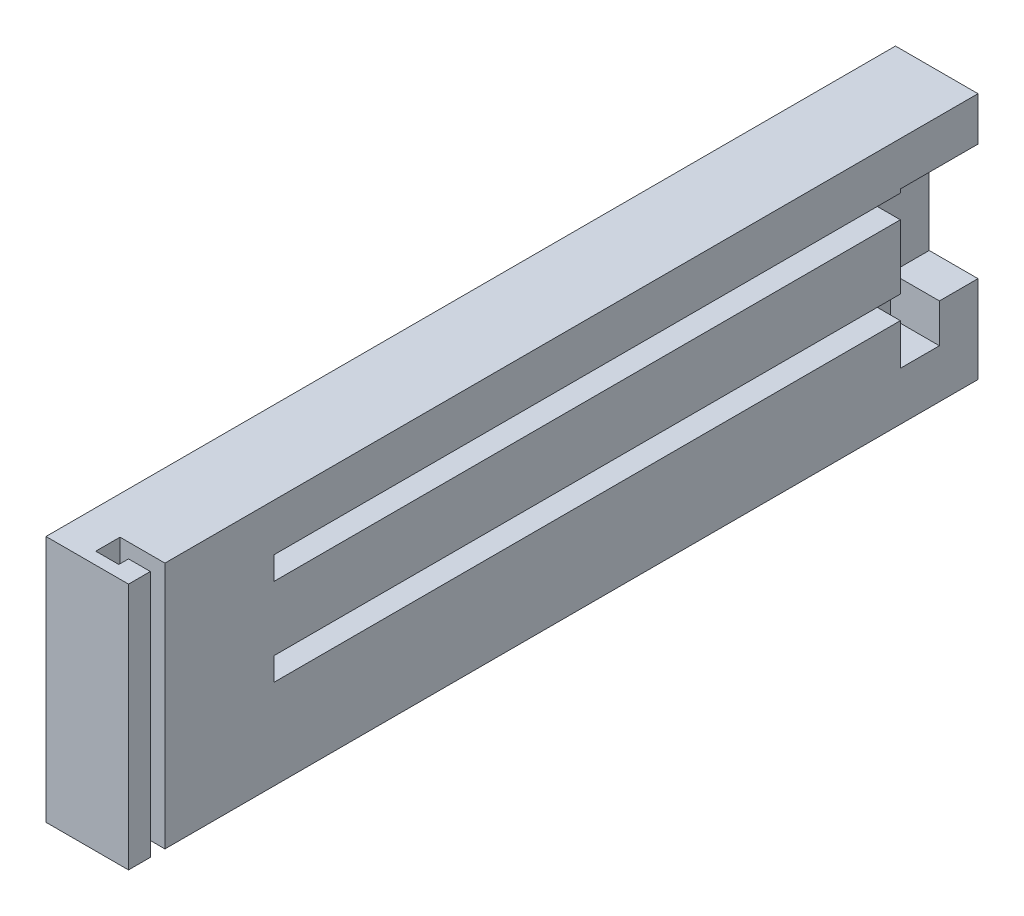
ISO-10303-21;
HEADER;
FILE_DESCRIPTION(('STEP AP214'),'2;1');
FILE_NAME('part.step','',(''),(''),'','','');
FILE_SCHEMA(('AUTOMOTIVE_DESIGN { 1 0 10303 214 1 1 1 1 }'));
ENDSEC;
DATA;
#1=APPLICATION_CONTEXT('core data for automotive mechanical design processes');
#2=APPLICATION_PROTOCOL_DEFINITION('international standard','automotive_design',2000,#1);
#3=PRODUCT_CONTEXT('',#1,'mechanical');
#4=PRODUCT('Part','Part','',(#3));
#5=PRODUCT_RELATED_PRODUCT_CATEGORY('part','',(#4));
#6=PRODUCT_DEFINITION_FORMATION('','',#4);
#7=PRODUCT_DEFINITION_CONTEXT('part definition',#1,'design');
#8=PRODUCT_DEFINITION('design','',#6,#7);
#9=PRODUCT_DEFINITION_SHAPE('','',#8);
#10=(LENGTH_UNIT() NAMED_UNIT(*) SI_UNIT(.MILLI.,.METRE.));
#11=(NAMED_UNIT(*) PLANE_ANGLE_UNIT() SI_UNIT($,.RADIAN.));
#12=(NAMED_UNIT(*) SI_UNIT($,.STERADIAN.) SOLID_ANGLE_UNIT());
#13=UNCERTAINTY_MEASURE_WITH_UNIT(LENGTH_MEASURE(1.E-05),#10,'distance_accuracy_value','');
#14=(GEOMETRIC_REPRESENTATION_CONTEXT(3) GLOBAL_UNCERTAINTY_ASSIGNED_CONTEXT((#13)) GLOBAL_UNIT_ASSIGNED_CONTEXT((#10,
#11,#12)) REPRESENTATION_CONTEXT('',''));
#15=CARTESIAN_POINT('',(0.,0.,0.));
#16=DIRECTION('',(0.,0.,1.));
#17=DIRECTION('',(1.,0.,0.));
#18=AXIS2_PLACEMENT_3D('',#15,#16,#17);
#19=CARTESIAN_POINT('',(17.,0.,0.));
#20=DIRECTION('',(-1.,0.,0.));
#21=DIRECTION('',(0.,0.,1.));
#22=AXIS2_PLACEMENT_3D('',#19,#20,#21);
#23=PLANE('',#22);
#24=DIRECTION('',(0.,0.,-1.));
#25=VECTOR('',#24,1.);
#26=CARTESIAN_POINT('',(17.,-10.4427333974976,-94.4379210779596));
#27=LINE('',#26,#25);
#28=CARTESIAN_POINT('',(17.,-10.4427333974976,-94.4379210779596));
#29=VERTEX_POINT('',#28);
#30=CARTESIAN_POINT('',(17.,-10.4427333974976,-102.48792107796));
#31=VERTEX_POINT('',#30);
#32=EDGE_CURVE('E220',#29,#31,#27,.T.);
#33=ORIENTED_EDGE('',*,*,#32,.F.);
#34=DIRECTION('',(0.,-1.,0.));
#35=VECTOR('',#34,1.);
#36=CARTESIAN_POINT('',(17.,0.,-94.4379210779596));
#37=LINE('',#36,#35);
#38=CARTESIAN_POINT('',(17.,-1.94273339749771,-94.4379210779596));
#39=VERTEX_POINT('',#38);
#40=EDGE_CURVE('E275',#39,#29,#37,.T.);
#41=ORIENTED_EDGE('',*,*,#40,.F.);
#42=DIRECTION('',(0.,0.,-1.));
#43=VECTOR('',#42,1.);
#44=CARTESIAN_POINT('',(17.,-1.94273339749762,34.5620789220404));
#45=LINE('',#44,#43);
#46=CARTESIAN_POINT('',(17.,-1.94273339749762,34.5620789220404));
#47=VERTEX_POINT('',#46);
#48=EDGE_CURVE('E317',#47,#39,#45,.T.);
#49=ORIENTED_EDGE('',*,*,#48,.F.);
#50=DIRECTION('',(0.,-1.,0.));
#51=VECTOR('',#50,1.);
#52=CARTESIAN_POINT('',(17.,0.,34.5620789220404));
#53=LINE('',#52,#51);
#54=CARTESIAN_POINT('',(17.,2.80726660250238,34.5620789220404));
#55=VERTEX_POINT('',#54);
#56=EDGE_CURVE('E312',#55,#47,#53,.T.);
#57=ORIENTED_EDGE('',*,*,#56,.F.);
#58=DIRECTION('',(0.,0.,-1.));
#59=VECTOR('',#58,1.);
#60=CARTESIAN_POINT('',(17.,2.80726660250238,34.5620789220404));
#61=LINE('',#60,#59);
#62=CARTESIAN_POINT('',(17.,2.80726660250229,-94.4379210779596));
#63=VERTEX_POINT('',#62);
#64=EDGE_CURVE('E322',#55,#63,#61,.T.);
#65=ORIENTED_EDGE('',*,*,#64,.T.);
#66=DIRECTION('',(0.,-1.,0.));
#67=VECTOR('',#66,1.);
#68=CARTESIAN_POINT('',(17.,0.,-94.4379210779596));
#69=LINE('',#68,#67);
#70=CARTESIAN_POINT('',(17.,16.0572666025023,-94.4379210779596));
#71=VERTEX_POINT('',#70);
#72=EDGE_CURVE('E264',#71,#63,#69,.T.);
#73=ORIENTED_EDGE('',*,*,#72,.F.);
#74=DIRECTION('',(0.,0.,-1.));
#75=VECTOR('',#74,1.);
#76=CARTESIAN_POINT('',(17.,16.0572666025024,34.5620789220404));
#77=LINE('',#76,#75);
#78=CARTESIAN_POINT('',(17.,16.0572666025024,34.5620789220404));
#79=VERTEX_POINT('',#78);
#80=EDGE_CURVE('E340',#79,#71,#77,.T.);
#81=ORIENTED_EDGE('',*,*,#80,.F.);
#82=DIRECTION('',(0.,1.,0.));
#83=VECTOR('',#82,1.);
#84=CARTESIAN_POINT('',(17.,16.0572666025024,34.5620789220404));
#85=LINE('',#84,#83);
#86=CARTESIAN_POINT('',(17.,20.8072666025024,34.5620789220404));
#87=VERTEX_POINT('',#86);
#88=EDGE_CURVE('E348',#79,#87,#85,.T.);
#89=ORIENTED_EDGE('',*,*,#88,.T.);
#90=DIRECTION('',(0.,0.,-1.));
#91=VECTOR('',#90,1.);
#92=CARTESIAN_POINT('',(17.,20.8072666025024,34.5620789220404));
#93=LINE('',#92,#91);
#94=CARTESIAN_POINT('',(17.,20.8072666025023,-94.4379210779596));
#95=VERTEX_POINT('',#94);
#96=EDGE_CURVE('E344',#87,#95,#93,.T.);
#97=ORIENTED_EDGE('',*,*,#96,.T.);
#98=DIRECTION('',(0.,-1.,0.));
#99=VECTOR('',#98,1.);
#100=CARTESIAN_POINT('',(17.,0.,-94.4379210779596));
#101=LINE('',#100,#99);
#102=CARTESIAN_POINT('',(17.,21.5572666025024,-94.4379210779596));
#103=VERTEX_POINT('',#102);
#104=EDGE_CURVE('E252',#103,#95,#101,.T.);
#105=ORIENTED_EDGE('',*,*,#104,.F.);
#106=DIRECTION('',(0.,0.,-1.));
#107=VECTOR('',#106,1.);
#108=CARTESIAN_POINT('',(17.,21.5572666025024,-94.4379210779596));
#109=LINE('',#108,#107);
#110=CARTESIAN_POINT('',(17.,21.5572666025024,-110.43792107796));
#111=VERTEX_POINT('',#110);
#112=EDGE_CURVE('E292',#103,#111,#109,.T.);
#113=ORIENTED_EDGE('',*,*,#112,.T.);
#114=DIRECTION('',(0.,-1.,0.));
#115=VECTOR('',#114,1.);
#116=CARTESIAN_POINT('',(17.,30.5572666025024,-110.43792107796));
#117=LINE('',#116,#115);
#118=CARTESIAN_POINT('',(17.,30.5572666025024,-110.43792107796));
#119=VERTEX_POINT('',#118);
#120=EDGE_CURVE('E424',#119,#111,#117,.T.);
#121=ORIENTED_EDGE('',*,*,#120,.F.);
#122=DIRECTION('',(0.,0.,-1.));
#123=VECTOR('',#122,1.);
#124=CARTESIAN_POINT('',(17.,30.5572666025024,64.5620789220404));
#125=LINE('',#124,#123);
#126=CARTESIAN_POINT('',(17.,30.5572666025024,57.0620789220404));
#127=VERTEX_POINT('',#126);
#128=EDGE_CURVE('E423',#127,#119,#125,.T.);
#129=ORIENTED_EDGE('',*,*,#128,.F.);
#130=DIRECTION('',(0.,1.,0.));
#131=VECTOR('',#130,1.);
#132=CARTESIAN_POINT('',(17.,-20.4427333974976,57.0620789220404));
#133=LINE('',#132,#131);
#134=CARTESIAN_POINT('',(17.,-20.4427333974976,57.0620789220404));
#135=VERTEX_POINT('',#134);
#136=EDGE_CURVE('E410',#135,#127,#133,.T.);
#137=ORIENTED_EDGE('',*,*,#136,.F.);
#138=DIRECTION('',(0.,0.,-1.));
#139=VECTOR('',#138,1.);
#140=CARTESIAN_POINT('',(17.,-20.4427333974976,64.5620789220404));
#141=LINE('',#140,#139);
#142=CARTESIAN_POINT('',(17.,-20.4427333974976,-110.43792107796));
#143=VERTEX_POINT('',#142);
#144=EDGE_CURVE('E428',#135,#143,#141,.T.);
#145=ORIENTED_EDGE('',*,*,#144,.T.);
#146=CARTESIAN_POINT('',(17.,-2.4427333974976,-110.43792107796));
#147=VERTEX_POINT('',#146);
#148=EDGE_CURVE('E422',#147,#143,#117,.T.);
#149=ORIENTED_EDGE('',*,*,#148,.F.);
#150=DIRECTION('',(0.,0.,-1.));
#151=VECTOR('',#150,1.);
#152=CARTESIAN_POINT('',(17.,-2.4427333974976,-94.4379210779596));
#153=LINE('',#152,#151);
#154=CARTESIAN_POINT('',(17.,-2.4427333974976,-102.48792107796));
#155=VERTEX_POINT('',#154);
#156=EDGE_CURVE('E234',#155,#147,#153,.T.);
#157=ORIENTED_EDGE('',*,*,#156,.F.);
#158=DIRECTION('',(0.,1.,0.));
#159=VECTOR('',#158,1.);
#160=CARTESIAN_POINT('',(17.,-10.4427333974976,-102.48792107796));
#161=LINE('',#160,#159);
#162=EDGE_CURVE('E212',#31,#155,#161,.T.);
#163=ORIENTED_EDGE('',*,*,#162,.F.);
#164=EDGE_LOOP('',(#33,#41,#49,#57,#65,#73,#81,#89,#97,#105,#113,#121,#129,#137,#145,#149,#157,#163));
#165=FACE_BOUND('',#164,.T.);
#166=ADVANCED_FACE('F45',(#165),#23,.F.);
#167=CARTESIAN_POINT('',(17.,20.8072666025024,34.5620789220404));
#168=DIRECTION('',(0.,-1.,0.));
#169=DIRECTION('',(0.,0.,-1.));
#170=AXIS2_PLACEMENT_3D('',#167,#168,#169);
#171=PLANE('',#170);
#172=DIRECTION('',(0.,0.,-1.));
#173=VECTOR('',#172,1.);
#174=CARTESIAN_POINT('',(12.25,20.8072666025024,34.5620789220404));
#175=LINE('',#174,#173);
#176=CARTESIAN_POINT('',(12.25,20.8072666025024,34.5620789220404));
#177=VERTEX_POINT('',#176);
#178=CARTESIAN_POINT('',(12.25,20.8072666025023,-94.4379210779596));
#179=VERTEX_POINT('',#178);
#180=EDGE_CURVE('E291',#177,#179,#175,.T.);
#181=ORIENTED_EDGE('',*,*,#180,.T.);
#182=DIRECTION('',(-1.,0.,0.));
#183=VECTOR('',#182,1.);
#184=CARTESIAN_POINT('',(0.,20.8072666025023,-94.4379210779596));
#185=LINE('',#184,#183);
#186=EDGE_CURVE('E255',#95,#179,#185,.T.);
#187=ORIENTED_EDGE('',*,*,#186,.F.);
#188=ORIENTED_EDGE('',*,*,#96,.F.);
#189=DIRECTION('',(-1.,0.,0.));
#190=VECTOR('',#189,1.);
#191=CARTESIAN_POINT('',(17.,20.8072666025024,34.5620789220404));
#192=LINE('',#191,#190);
#193=EDGE_CURVE('E305',#87,#177,#192,.T.);
#194=ORIENTED_EDGE('',*,*,#193,.T.);
#195=EDGE_LOOP('',(#181,#187,#188,#194));
#196=FACE_BOUND('',#195,.T.);
#197=ADVANCED_FACE('F512',(#196),#171,.T.);
#198=CARTESIAN_POINT('',(12.25,16.0572666025024,34.5620789220404));
#199=DIRECTION('',(-1.,0.,0.));
#200=DIRECTION('',(0.,0.,1.));
#201=AXIS2_PLACEMENT_3D('',#198,#199,#200);
#202=PLANE('',#201);
#203=DIRECTION('',(0.,-1.,0.));
#204=VECTOR('',#203,1.);
#205=CARTESIAN_POINT('',(12.25,0.,-94.4379210779596));
#206=LINE('',#205,#204);
#207=CARTESIAN_POINT('',(12.25,16.0572666025023,-94.4379210779596));
#208=VERTEX_POINT('',#207);
#209=EDGE_CURVE('E258',#179,#208,#206,.T.);
#210=ORIENTED_EDGE('',*,*,#209,.F.);
#211=ORIENTED_EDGE('',*,*,#180,.F.);
#212=DIRECTION('',(0.,1.,0.));
#213=VECTOR('',#212,1.);
#214=CARTESIAN_POINT('',(12.25,16.0572666025024,34.5620789220404));
#215=LINE('',#214,#213);
#216=CARTESIAN_POINT('',(12.25,16.0572666025024,34.5620789220404));
#217=VERTEX_POINT('',#216);
#218=EDGE_CURVE('E356',#217,#177,#215,.T.);
#219=ORIENTED_EDGE('',*,*,#218,.F.);
#220=DIRECTION('',(0.,0.,-1.));
#221=VECTOR('',#220,1.);
#222=CARTESIAN_POINT('',(12.25,16.0572666025024,34.5620789220404));
#223=LINE('',#222,#221);
#224=EDGE_CURVE('E336',#217,#208,#223,.T.);
#225=ORIENTED_EDGE('',*,*,#224,.T.);
#226=EDGE_LOOP('',(#210,#211,#219,#225));
#227=FACE_BOUND('',#226,.T.);
#228=ADVANCED_FACE('F517',(#227),#202,.F.);
#229=CARTESIAN_POINT('',(17.,16.0572666025024,34.5620789220404));
#230=DIRECTION('',(0.,-1.,0.));
#231=DIRECTION('',(0.,0.,-1.));
#232=AXIS2_PLACEMENT_3D('',#229,#230,#231);
#233=PLANE('',#232);
#234=DIRECTION('',(1.,0.,0.));
#235=VECTOR('',#234,1.);
#236=CARTESIAN_POINT('',(0.,16.0572666025023,-94.4379210779596));
#237=LINE('',#236,#235);
#238=EDGE_CURVE('E261',#208,#71,#237,.T.);
#239=ORIENTED_EDGE('',*,*,#238,.F.);
#240=ORIENTED_EDGE('',*,*,#224,.F.);
#241=DIRECTION('',(-1.,0.,0.));
#242=VECTOR('',#241,1.);
#243=CARTESIAN_POINT('',(17.,16.0572666025024,34.5620789220404));
#244=LINE('',#243,#242);
#245=EDGE_CURVE('E352',#79,#217,#244,.T.);
#246=ORIENTED_EDGE('',*,*,#245,.F.);
#247=ORIENTED_EDGE('',*,*,#80,.T.);
#248=EDGE_LOOP('',(#239,#240,#246,#247));
#249=FACE_BOUND('',#248,.T.);
#250=ADVANCED_FACE('F550',(#249),#233,.F.);
#251=CARTESIAN_POINT('',(0.,-1.94273339749762,34.5620789220404));
#252=DIRECTION('',(0.,1.,0.));
#253=DIRECTION('',(0.,0.,1.));
#254=AXIS2_PLACEMENT_3D('',#251,#252,#253);
#255=PLANE('',#254);
#256=ORIENTED_EDGE('',*,*,#48,.T.);
#257=DIRECTION('',(1.,0.,0.));
#258=VECTOR('',#257,1.);
#259=CARTESIAN_POINT('',(0.,-1.94273339749771,-94.4379210779596));
#260=LINE('',#259,#258);
#261=CARTESIAN_POINT('',(12.25,-1.94273339749771,-94.4379210779596));
#262=VERTEX_POINT('',#261);
#263=EDGE_CURVE('E272',#262,#39,#260,.T.);
#264=ORIENTED_EDGE('',*,*,#263,.F.);
#265=DIRECTION('',(0.,0.,-1.));
#266=VECTOR('',#265,1.);
#267=CARTESIAN_POINT('',(12.25,-1.94273339749762,34.5620789220404));
#268=LINE('',#267,#266);
#269=CARTESIAN_POINT('',(12.25,-1.94273339749762,34.5620789220404));
#270=VERTEX_POINT('',#269);
#271=EDGE_CURVE('E316',#270,#262,#268,.T.);
#272=ORIENTED_EDGE('',*,*,#271,.F.);
#273=DIRECTION('',(1.,0.,0.));
#274=VECTOR('',#273,1.);
#275=CARTESIAN_POINT('',(0.,-1.94273339749762,34.5620789220404));
#276=LINE('',#275,#274);
#277=EDGE_CURVE('E301',#270,#47,#276,.T.);
#278=ORIENTED_EDGE('',*,*,#277,.T.);
#279=EDGE_LOOP('',(#256,#264,#272,#278));
#280=FACE_BOUND('',#279,.T.);
#281=ADVANCED_FACE('F544',(#280),#255,.T.);
#282=CARTESIAN_POINT('',(0.,2.80726660250238,34.5620789220404));
#283=DIRECTION('',(0.,1.,0.));
#284=DIRECTION('',(0.,0.,1.));
#285=AXIS2_PLACEMENT_3D('',#282,#283,#284);
#286=PLANE('',#285);
#287=DIRECTION('',(-1.,0.,0.));
#288=VECTOR('',#287,1.);
#289=CARTESIAN_POINT('',(0.,2.80726660250229,-94.4379210779596));
#290=LINE('',#289,#288);
#291=CARTESIAN_POINT('',(12.25,2.8072666025023,-94.4379210779596));
#292=VERTEX_POINT('',#291);
#293=EDGE_CURVE('E63',#63,#292,#290,.T.);
#294=ORIENTED_EDGE('',*,*,#293,.F.);
#295=ORIENTED_EDGE('',*,*,#64,.F.);
#296=DIRECTION('',(1.,0.,0.));
#297=VECTOR('',#296,1.);
#298=CARTESIAN_POINT('',(0.,2.80726660250238,34.5620789220404));
#299=LINE('',#298,#297);
#300=CARTESIAN_POINT('',(12.25,2.80726660250238,34.5620789220404));
#301=VERTEX_POINT('',#300);
#302=EDGE_CURVE('E308',#301,#55,#299,.T.);
#303=ORIENTED_EDGE('',*,*,#302,.F.);
#304=DIRECTION('',(0.,0.,-1.));
#305=VECTOR('',#304,1.);
#306=CARTESIAN_POINT('',(12.25,2.80726660250238,34.5620789220404));
#307=LINE('',#306,#305);
#308=EDGE_CURVE('E326',#301,#292,#307,.T.);
#309=ORIENTED_EDGE('',*,*,#308,.T.);
#310=EDGE_LOOP('',(#294,#295,#303,#309));
#311=FACE_BOUND('',#310,.T.);
#312=ADVANCED_FACE('F538',(#311),#286,.F.);
#313=CARTESIAN_POINT('',(12.25,0.,34.5620789220404));
#314=DIRECTION('',(1.,0.,0.));
#315=DIRECTION('',(0.,0.,-1.));
#316=AXIS2_PLACEMENT_3D('',#313,#314,#315);
#317=PLANE('',#316);
#318=ORIENTED_EDGE('',*,*,#271,.T.);
#319=DIRECTION('',(0.,-1.,0.));
#320=VECTOR('',#319,1.);
#321=CARTESIAN_POINT('',(12.25,0.,-94.4379210779596));
#322=LINE('',#321,#320);
#323=EDGE_CURVE('E269',#292,#262,#322,.T.);
#324=ORIENTED_EDGE('',*,*,#323,.F.);
#325=ORIENTED_EDGE('',*,*,#308,.F.);
#326=DIRECTION('',(0.,-1.,0.));
#327=VECTOR('',#326,1.);
#328=CARTESIAN_POINT('',(12.25,0.,34.5620789220404));
#329=LINE('',#328,#327);
#330=EDGE_CURVE('E304',#301,#270,#329,.T.);
#331=ORIENTED_EDGE('',*,*,#330,.T.);
#332=EDGE_LOOP('',(#318,#324,#325,#331));
#333=FACE_BOUND('',#332,.T.);
#334=ADVANCED_FACE('F533',(#333),#317,.T.);
#335=CARTESIAN_POINT('',(17.,30.5572666025024,-110.43792107796));
#336=DIRECTION('',(0.,0.,-1.));
#337=DIRECTION('',(-1.,0.,0.));
#338=AXIS2_PLACEMENT_3D('',#335,#336,#337);
#339=PLANE('',#338);
#340=DIRECTION('',(-1.,0.,0.));
#341=VECTOR('',#340,1.);
#342=CARTESIAN_POINT('',(0.,-2.4427333974976,-110.43792107796));
#343=LINE('',#342,#341);
#344=CARTESIAN_POINT('',(6.95,-2.4427333974976,-110.43792107796));
#345=VERTEX_POINT('',#344);
#346=EDGE_CURVE('E239',#147,#345,#343,.T.);
#347=ORIENTED_EDGE('',*,*,#346,.F.);
#348=ORIENTED_EDGE('',*,*,#148,.T.);
#349=DIRECTION('',(-1.,0.,0.));
#350=VECTOR('',#349,1.);
#351=CARTESIAN_POINT('',(17.,-20.4427333974976,-110.43792107796));
#352=LINE('',#351,#350);
#353=CARTESIAN_POINT('',(0.,-20.4427333974976,-110.43792107796));
#354=VERTEX_POINT('',#353);
#355=EDGE_CURVE('E452',#143,#354,#352,.T.);
#356=ORIENTED_EDGE('',*,*,#355,.T.);
#357=DIRECTION('',(0.,-1.,0.));
#358=VECTOR('',#357,1.);
#359=CARTESIAN_POINT('',(0.,30.5572666025024,-110.43792107796));
#360=LINE('',#359,#358);
#361=CARTESIAN_POINT('',(0.,30.5572666025024,-110.43792107796));
#362=VERTEX_POINT('',#361);
#363=EDGE_CURVE('E439',#362,#354,#360,.T.);
#364=ORIENTED_EDGE('',*,*,#363,.F.);
#365=DIRECTION('',(-1.,0.,0.));
#366=VECTOR('',#365,1.);
#367=CARTESIAN_POINT('',(17.,30.5572666025024,-110.43792107796));
#368=LINE('',#367,#366);
#369=EDGE_CURVE('E49',#119,#362,#368,.T.);
#370=ORIENTED_EDGE('',*,*,#369,.F.);
#371=ORIENTED_EDGE('',*,*,#120,.T.);
#372=DIRECTION('',(-1.,0.,0.));
#373=VECTOR('',#372,1.);
#374=CARTESIAN_POINT('',(0.,21.5572666025024,-110.43792107796));
#375=LINE('',#374,#373);
#376=CARTESIAN_POINT('',(6.95,21.5572666025024,-110.43792107796));
#377=VERTEX_POINT('',#376);
#378=EDGE_CURVE('E249',#111,#377,#375,.T.);
#379=ORIENTED_EDGE('',*,*,#378,.T.);
#380=DIRECTION('',(0.,1.,0.));
#381=VECTOR('',#380,1.);
#382=CARTESIAN_POINT('',(6.95,0.,-110.43792107796));
#383=LINE('',#382,#381);
#384=EDGE_CURVE('E282',#345,#377,#383,.T.);
#385=ORIENTED_EDGE('',*,*,#384,.F.);
#386=EDGE_LOOP('',(#347,#348,#356,#364,#370,#371,#379,#385));
#387=FACE_BOUND('',#386,.T.);
#388=ADVANCED_FACE('F465',(#387),#339,.T.);
#389=CARTESIAN_POINT('',(17.,30.5572666025024,64.5620789220404));
#390=DIRECTION('',(0.,1.,0.));
#391=DIRECTION('',(0.,0.,1.));
#392=AXIS2_PLACEMENT_3D('',#389,#390,#391);
#393=PLANE('',#392);
#394=DIRECTION('',(-1.,0.,0.));
#395=VECTOR('',#394,1.);
#396=CARTESIAN_POINT('',(0.,30.5572666025024,57.0620789220404));
#397=LINE('',#396,#395);
#398=CARTESIAN_POINT('',(7.75,30.5572666025024,57.0620789220404));
#399=VERTEX_POINT('',#398);
#400=EDGE_CURVE('E389',#127,#399,#397,.T.);
#401=ORIENTED_EDGE('',*,*,#400,.F.);
#402=ORIENTED_EDGE('',*,*,#128,.T.);
#403=ORIENTED_EDGE('',*,*,#369,.T.);
#404=DIRECTION('',(0.,0.,-1.));
#405=VECTOR('',#404,1.);
#406=CARTESIAN_POINT('',(0.,30.5572666025024,64.5620789220404));
#407=LINE('',#406,#405);
#408=CARTESIAN_POINT('',(0.,30.5572666025024,64.5620789220404));
#409=VERTEX_POINT('',#408);
#410=EDGE_CURVE('E403',#409,#362,#407,.T.);
#411=ORIENTED_EDGE('',*,*,#410,.F.);
#412=DIRECTION('',(-1.,0.,0.));
#413=VECTOR('',#412,1.);
#414=CARTESIAN_POINT('',(17.,30.5572666025024,64.5620789220404));
#415=LINE('',#414,#413);
#416=CARTESIAN_POINT('',(17.,30.5572666025024,64.5620789220404));
#417=VERTEX_POINT('',#416);
#418=EDGE_CURVE('E11',#417,#409,#415,.T.);
#419=ORIENTED_EDGE('',*,*,#418,.F.);
#420=CARTESIAN_POINT('',(17.,30.5572666025024,60.0620789220404));
#421=VERTEX_POINT('',#420);
#422=EDGE_CURVE('E418',#417,#421,#125,.T.);
#423=ORIENTED_EDGE('',*,*,#422,.T.);
#424=DIRECTION('',(1.,0.,0.));
#425=VECTOR('',#424,1.);
#426=CARTESIAN_POINT('',(0.,30.5572666025024,60.0620789220404));
#427=LINE('',#426,#425);
#428=CARTESIAN_POINT('',(12.5,30.5572666025024,60.0620789220404));
#429=VERTEX_POINT('',#428);
#430=EDGE_CURVE('E71',#429,#421,#427,.T.);
#431=ORIENTED_EDGE('',*,*,#430,.F.);
#432=DIRECTION('',(0.,0.,-1.));
#433=VECTOR('',#432,1.);
#434=CARTESIAN_POINT('',(12.5,30.5572666025024,0.));
#435=LINE('',#434,#433);
#436=CARTESIAN_POINT('',(12.5,30.5572666025024,62.0620789220404));
#437=VERTEX_POINT('',#436);
#438=EDGE_CURVE('E321',#437,#429,#435,.T.);
#439=ORIENTED_EDGE('',*,*,#438,.F.);
#440=DIRECTION('',(1.,0.,0.));
#441=VECTOR('',#440,1.);
#442=CARTESIAN_POINT('',(0.,30.5572666025024,62.0620789220404));
#443=LINE('',#442,#441);
#444=CARTESIAN_POINT('',(7.75,30.5572666025024,62.0620789220404));
#445=VERTEX_POINT('',#444);
#446=EDGE_CURVE('E367',#445,#437,#443,.T.);
#447=ORIENTED_EDGE('',*,*,#446,.F.);
#448=DIRECTION('',(0.,0.,1.));
#449=VECTOR('',#448,1.);
#450=CARTESIAN_POINT('',(7.74999999999998,30.5572666025024,0.));
#451=LINE('',#450,#449);
#452=EDGE_CURVE('E393',#399,#445,#451,.T.);
#453=ORIENTED_EDGE('',*,*,#452,.F.);
#454=EDGE_LOOP('',(#401,#402,#403,#411,#419,#423,#431,#439,#447,#453));
#455=FACE_BOUND('',#454,.T.);
#456=ADVANCED_FACE('F47',(#455),#393,.T.);
#457=CARTESIAN_POINT('',(17.,30.5572666025024,64.5620789220404));
#458=DIRECTION('',(0.,0.,-1.));
#459=DIRECTION('',(-1.,0.,0.));
#460=AXIS2_PLACEMENT_3D('',#457,#458,#459);
#461=PLANE('',#460);
#462=DIRECTION('',(0.,-1.,0.));
#463=VECTOR('',#462,1.);
#464=CARTESIAN_POINT('',(0.,30.5572666025024,64.5620789220404));
#465=LINE('',#464,#463);
#466=CARTESIAN_POINT('',(0.,-20.4427333974976,64.5620789220404));
#467=VERTEX_POINT('',#466);
#468=EDGE_CURVE('E447',#409,#467,#465,.T.);
#469=ORIENTED_EDGE('',*,*,#468,.T.);
#470=DIRECTION('',(-1.,0.,0.));
#471=VECTOR('',#470,1.);
#472=CARTESIAN_POINT('',(17.,-20.4427333974976,64.5620789220404));
#473=LINE('',#472,#471);
#474=CARTESIAN_POINT('',(17.,-20.4427333974976,64.5620789220404));
#475=VERTEX_POINT('',#474);
#476=EDGE_CURVE('E55',#475,#467,#473,.T.);
#477=ORIENTED_EDGE('',*,*,#476,.F.);
#478=DIRECTION('',(0.,-1.,0.));
#479=VECTOR('',#478,1.);
#480=CARTESIAN_POINT('',(17.,30.5572666025024,64.5620789220404));
#481=LINE('',#480,#479);
#482=EDGE_CURVE('E433',#417,#475,#481,.T.);
#483=ORIENTED_EDGE('',*,*,#482,.F.);
#484=ORIENTED_EDGE('',*,*,#418,.T.);
#485=EDGE_LOOP('',(#469,#477,#483,#484));
#486=FACE_BOUND('',#485,.T.);
#487=ADVANCED_FACE('F472',(#486),#461,.F.);
#488=CARTESIAN_POINT('',(17.,-20.4427333974976,64.5620789220404));
#489=DIRECTION('',(0.,1.,0.));
#490=DIRECTION('',(0.,0.,1.));
#491=AXIS2_PLACEMENT_3D('',#488,#489,#490);
#492=PLANE('',#491);
#493=ORIENTED_EDGE('',*,*,#144,.F.);
#494=DIRECTION('',(-1.,0.,0.));
#495=VECTOR('',#494,1.);
#496=CARTESIAN_POINT('',(0.,-20.4427333974976,57.0620789220404));
#497=LINE('',#496,#495);
#498=CARTESIAN_POINT('',(7.75,-20.4427333974976,57.0620789220404));
#499=VERTEX_POINT('',#498);
#500=EDGE_CURVE('E371',#135,#499,#497,.T.);
#501=ORIENTED_EDGE('',*,*,#500,.T.);
#502=DIRECTION('',(0.,0.,1.));
#503=VECTOR('',#502,1.);
#504=CARTESIAN_POINT('',(7.74999999999998,-20.4427333974976,0.));
#505=LINE('',#504,#503);
#506=CARTESIAN_POINT('',(7.75,-20.4427333974976,62.0620789220404));
#507=VERTEX_POINT('',#506);
#508=EDGE_CURVE('E375',#499,#507,#505,.T.);
#509=ORIENTED_EDGE('',*,*,#508,.T.);
#510=DIRECTION('',(1.,0.,0.));
#511=VECTOR('',#510,1.);
#512=CARTESIAN_POINT('',(0.,-20.4427333974976,62.0620789220404));
#513=LINE('',#512,#511);
#514=CARTESIAN_POINT('',(12.5,-20.4427333974976,62.0620789220404));
#515=VERTEX_POINT('',#514);
#516=EDGE_CURVE('E379',#507,#515,#513,.T.);
#517=ORIENTED_EDGE('',*,*,#516,.T.);
#518=DIRECTION('',(0.,0.,-1.));
#519=VECTOR('',#518,1.);
#520=CARTESIAN_POINT('',(12.5,-20.4427333974976,0.));
#521=LINE('',#520,#519);
#522=CARTESIAN_POINT('',(12.5,-20.4427333974976,60.0620789220404));
#523=VERTEX_POINT('',#522);
#524=EDGE_CURVE('E362',#515,#523,#521,.T.);
#525=ORIENTED_EDGE('',*,*,#524,.T.);
#526=DIRECTION('',(1.,0.,0.));
#527=VECTOR('',#526,1.);
#528=CARTESIAN_POINT('',(0.,-20.4427333974976,60.0620789220404));
#529=LINE('',#528,#527);
#530=CARTESIAN_POINT('',(17.,-20.4427333974976,60.0620789220404));
#531=VERTEX_POINT('',#530);
#532=EDGE_CURVE('E366',#523,#531,#529,.T.);
#533=ORIENTED_EDGE('',*,*,#532,.T.);
#534=EDGE_CURVE('E429',#475,#531,#141,.T.);
#535=ORIENTED_EDGE('',*,*,#534,.F.);
#536=ORIENTED_EDGE('',*,*,#476,.T.);
#537=DIRECTION('',(0.,0.,-1.));
#538=VECTOR('',#537,1.);
#539=CARTESIAN_POINT('',(0.,-20.4427333974976,64.5620789220404));
#540=LINE('',#539,#538);
#541=EDGE_CURVE('E443',#467,#354,#540,.T.);
#542=ORIENTED_EDGE('',*,*,#541,.T.);
#543=ORIENTED_EDGE('',*,*,#355,.F.);
#544=EDGE_LOOP('',(#493,#501,#509,#517,#525,#533,#535,#536,#542,#543));
#545=FACE_BOUND('',#544,.T.);
#546=ADVANCED_FACE('F477',(#545),#492,.F.);
#547=ORIENTED_EDGE('',*,*,#534,.T.);
#548=DIRECTION('',(0.,1.,0.));
#549=VECTOR('',#548,1.);
#550=CARTESIAN_POINT('',(17.,-20.4427333974976,60.0620789220404));
#551=LINE('',#550,#549);
#552=EDGE_CURVE('E413',#531,#421,#551,.T.);
#553=ORIENTED_EDGE('',*,*,#552,.T.);
#554=ORIENTED_EDGE('',*,*,#422,.F.);
#555=ORIENTED_EDGE('',*,*,#482,.T.);
#556=EDGE_LOOP('',(#547,#553,#554,#555));
#557=FACE_BOUND('',#556,.T.);
#558=ADVANCED_FACE('F480',(#557),#23,.F.);
#559=CARTESIAN_POINT('',(0.,0.,0.));
#560=DIRECTION('',(-1.,0.,0.));
#561=DIRECTION('',(0.,0.,1.));
#562=AXIS2_PLACEMENT_3D('',#559,#560,#561);
#563=PLANE('',#562);
#564=ORIENTED_EDGE('',*,*,#410,.T.);
#565=ORIENTED_EDGE('',*,*,#363,.T.);
#566=ORIENTED_EDGE('',*,*,#541,.F.);
#567=ORIENTED_EDGE('',*,*,#468,.F.);
#568=EDGE_LOOP('',(#564,#565,#566,#567));
#569=FACE_BOUND('',#568,.T.);
#570=ADVANCED_FACE('F469',(#569),#563,.T.);
#571=CARTESIAN_POINT('',(12.5,-20.4427333974976,0.));
#572=DIRECTION('',(1.,0.,0.));
#573=DIRECTION('',(0.,0.,-1.));
#574=AXIS2_PLACEMENT_3D('',#571,#572,#573);
#575=PLANE('',#574);
#576=ORIENTED_EDGE('',*,*,#438,.T.);
#577=DIRECTION('',(0.,1.,0.));
#578=VECTOR('',#577,1.);
#579=CARTESIAN_POINT('',(12.5,-20.4427333974976,60.0620789220404));
#580=LINE('',#579,#578);
#581=EDGE_CURVE('E383',#523,#429,#580,.T.);
#582=ORIENTED_EDGE('',*,*,#581,.F.);
#583=ORIENTED_EDGE('',*,*,#524,.F.);
#584=DIRECTION('',(0.,1.,0.));
#585=VECTOR('',#584,1.);
#586=CARTESIAN_POINT('',(12.5,-20.4427333974976,62.0620789220404));
#587=LINE('',#586,#585);
#588=EDGE_CURVE('E400',#515,#437,#587,.T.);
#589=ORIENTED_EDGE('',*,*,#588,.T.);
#590=EDGE_LOOP('',(#576,#582,#583,#589));
#591=FACE_BOUND('',#590,.T.);
#592=ADVANCED_FACE('F486',(#591),#575,.F.);
#593=CARTESIAN_POINT('',(0.,-20.4427333974976,62.0620789220404));
#594=DIRECTION('',(0.,0.,1.));
#595=DIRECTION('',(1.,0.,0.));
#596=AXIS2_PLACEMENT_3D('',#593,#594,#595);
#597=PLANE('',#596);
#598=ORIENTED_EDGE('',*,*,#446,.T.);
#599=ORIENTED_EDGE('',*,*,#588,.F.);
#600=ORIENTED_EDGE('',*,*,#516,.F.);
#601=DIRECTION('',(0.,1.,0.));
#602=VECTOR('',#601,1.);
#603=CARTESIAN_POINT('',(7.75,-20.4427333974976,62.0620789220404));
#604=LINE('',#603,#602);
#605=EDGE_CURVE('E404',#507,#445,#604,.T.);
#606=ORIENTED_EDGE('',*,*,#605,.T.);
#607=EDGE_LOOP('',(#598,#599,#600,#606));
#608=FACE_BOUND('',#607,.T.);
#609=ADVANCED_FACE('F490',(#608),#597,.F.);
#610=CARTESIAN_POINT('',(7.74999999999998,-20.4427333974976,0.));
#611=DIRECTION('',(-1.,0.,0.));
#612=DIRECTION('',(0.,0.,1.));
#613=AXIS2_PLACEMENT_3D('',#610,#611,#612);
#614=PLANE('',#613);
#615=ORIENTED_EDGE('',*,*,#452,.T.);
#616=ORIENTED_EDGE('',*,*,#605,.F.);
#617=ORIENTED_EDGE('',*,*,#508,.F.);
#618=DIRECTION('',(0.,1.,0.));
#619=VECTOR('',#618,1.);
#620=CARTESIAN_POINT('',(7.75,-20.4427333974976,57.0620789220404));
#621=LINE('',#620,#619);
#622=EDGE_CURVE('E407',#499,#399,#621,.T.);
#623=ORIENTED_EDGE('',*,*,#622,.T.);
#624=EDGE_LOOP('',(#615,#616,#617,#623));
#625=FACE_BOUND('',#624,.T.);
#626=ADVANCED_FACE('F493',(#625),#614,.F.);
#627=CARTESIAN_POINT('',(0.,-20.4427333974976,57.0620789220404));
#628=DIRECTION('',(0.,0.,-1.));
#629=DIRECTION('',(-1.,0.,0.));
#630=AXIS2_PLACEMENT_3D('',#627,#628,#629);
#631=PLANE('',#630);
#632=ORIENTED_EDGE('',*,*,#400,.T.);
#633=ORIENTED_EDGE('',*,*,#622,.F.);
#634=ORIENTED_EDGE('',*,*,#500,.F.);
#635=ORIENTED_EDGE('',*,*,#136,.T.);
#636=EDGE_LOOP('',(#632,#633,#634,#635));
#637=FACE_BOUND('',#636,.T.);
#638=ADVANCED_FACE('F500',(#637),#631,.F.);
#639=CARTESIAN_POINT('',(0.,-20.4427333974976,60.0620789220404));
#640=DIRECTION('',(0.,0.,1.));
#641=DIRECTION('',(1.,0.,0.));
#642=AXIS2_PLACEMENT_3D('',#639,#640,#641);
#643=PLANE('',#642);
#644=ORIENTED_EDGE('',*,*,#430,.T.);
#645=ORIENTED_EDGE('',*,*,#552,.F.);
#646=ORIENTED_EDGE('',*,*,#532,.F.);
#647=ORIENTED_EDGE('',*,*,#581,.T.);
#648=EDGE_LOOP('',(#644,#645,#646,#647));
#649=FACE_BOUND('',#648,.T.);
#650=ADVANCED_FACE('F502',(#649),#643,.F.);
#651=CARTESIAN_POINT('',(0.,0.,34.5620789220404));
#652=DIRECTION('',(0.,0.,-1.));
#653=DIRECTION('',(-1.,0.,0.));
#654=AXIS2_PLACEMENT_3D('',#651,#652,#653);
#655=PLANE('',#654);
#656=ORIENTED_EDGE('',*,*,#193,.F.);
#657=ORIENTED_EDGE('',*,*,#88,.F.);
#658=ORIENTED_EDGE('',*,*,#245,.T.);
#659=ORIENTED_EDGE('',*,*,#218,.T.);
#660=EDGE_LOOP('',(#656,#657,#658,#659));
#661=FACE_BOUND('',#660,.T.);
#662=ADVANCED_FACE('F508',(#661),#655,.T.);
#663=CARTESIAN_POINT('',(0.,0.,34.5620789220404));
#664=DIRECTION('',(0.,0.,-1.));
#665=DIRECTION('',(0.,1.,0.));
#666=AXIS2_PLACEMENT_3D('',#663,#664,#665);
#667=PLANE('',#666);
#668=ORIENTED_EDGE('',*,*,#277,.F.);
#669=ORIENTED_EDGE('',*,*,#330,.F.);
#670=ORIENTED_EDGE('',*,*,#302,.T.);
#671=ORIENTED_EDGE('',*,*,#56,.T.);
#672=EDGE_LOOP('',(#668,#669,#670,#671));
#673=FACE_BOUND('',#672,.T.);
#674=ADVANCED_FACE('F561',(#673),#667,.T.);
#675=CARTESIAN_POINT('',(0.,-2.4427333974976,-94.4379210779596));
#676=DIRECTION('',(0.,-1.,0.));
#677=DIRECTION('',(0.,0.,-1.));
#678=AXIS2_PLACEMENT_3D('',#675,#676,#677);
#679=PLANE('',#678);
#680=DIRECTION('',(0.,0.,-1.));
#681=VECTOR('',#680,1.);
#682=CARTESIAN_POINT('',(6.95,-2.4427333974976,-94.4379210779596));
#683=LINE('',#682,#681);
#684=CARTESIAN_POINT('',(6.95,-2.4427333974976,-102.48792107796));
#685=VERTEX_POINT('',#684);
#686=EDGE_CURVE('E278',#685,#345,#683,.T.);
#687=ORIENTED_EDGE('',*,*,#686,.F.);
#688=DIRECTION('',(-1.,0.,0.));
#689=VECTOR('',#688,1.);
#690=CARTESIAN_POINT('',(17.,-2.4427333974976,-102.48792107796));
#691=LINE('',#690,#689);
#692=EDGE_CURVE('E230',#155,#685,#691,.T.);
#693=ORIENTED_EDGE('',*,*,#692,.F.);
#694=ORIENTED_EDGE('',*,*,#156,.T.);
#695=ORIENTED_EDGE('',*,*,#346,.T.);
#696=EDGE_LOOP('',(#687,#693,#694,#695));
#697=FACE_BOUND('',#696,.T.);
#698=ADVANCED_FACE('F645',(#697),#679,.F.);
#699=CARTESIAN_POINT('',(0.,21.5572666025024,-94.4379210779596));
#700=DIRECTION('',(0.,-1.,0.));
#701=DIRECTION('',(0.,0.,-1.));
#702=AXIS2_PLACEMENT_3D('',#699,#700,#701);
#703=PLANE('',#702);
#704=ORIENTED_EDGE('',*,*,#378,.F.);
#705=ORIENTED_EDGE('',*,*,#112,.F.);
#706=DIRECTION('',(-1.,0.,0.));
#707=VECTOR('',#706,1.);
#708=CARTESIAN_POINT('',(0.,21.5572666025024,-94.4379210779596));
#709=LINE('',#708,#707);
#710=CARTESIAN_POINT('',(6.95,21.5572666025024,-94.4379210779596));
#711=VERTEX_POINT('',#710);
#712=EDGE_CURVE('E248',#103,#711,#709,.T.);
#713=ORIENTED_EDGE('',*,*,#712,.T.);
#714=DIRECTION('',(0.,0.,-1.));
#715=VECTOR('',#714,1.);
#716=CARTESIAN_POINT('',(6.95,21.5572666025024,-94.4379210779596));
#717=LINE('',#716,#715);
#718=EDGE_CURVE('E296',#711,#377,#717,.T.);
#719=ORIENTED_EDGE('',*,*,#718,.T.);
#720=EDGE_LOOP('',(#704,#705,#713,#719));
#721=FACE_BOUND('',#720,.T.);
#722=ADVANCED_FACE('F703',(#721),#703,.T.);
#723=CARTESIAN_POINT('',(6.95,0.,-94.4379210779596));
#724=DIRECTION('',(-1.,0.,0.));
#725=DIRECTION('',(0.,0.,1.));
#726=AXIS2_PLACEMENT_3D('',#723,#724,#725);
#727=PLANE('',#726);
#728=ORIENTED_EDGE('',*,*,#384,.T.);
#729=ORIENTED_EDGE('',*,*,#718,.F.);
#730=DIRECTION('',(0.,1.,0.));
#731=VECTOR('',#730,1.);
#732=CARTESIAN_POINT('',(6.95,0.,-94.4379210779596));
#733=LINE('',#732,#731);
#734=CARTESIAN_POINT('',(6.95,-10.4427333974976,-94.4379210779596));
#735=VERTEX_POINT('',#734);
#736=EDGE_CURVE('E244',#735,#711,#733,.T.);
#737=ORIENTED_EDGE('',*,*,#736,.F.);
#738=DIRECTION('',(0.,0.,1.));
#739=VECTOR('',#738,1.);
#740=CARTESIAN_POINT('',(6.95,-10.4427333974976,-94.4379210779596));
#741=LINE('',#740,#739);
#742=CARTESIAN_POINT('',(6.95,-10.4427333974976,-102.48792107796));
#743=VERTEX_POINT('',#742);
#744=EDGE_CURVE('E219',#743,#735,#741,.T.);
#745=ORIENTED_EDGE('',*,*,#744,.F.);
#746=DIRECTION('',(0.,1.,0.));
#747=VECTOR('',#746,1.);
#748=CARTESIAN_POINT('',(6.95,-10.4427333974976,-102.48792107796));
#749=LINE('',#748,#747);
#750=EDGE_CURVE('E214',#743,#685,#749,.T.);
#751=ORIENTED_EDGE('',*,*,#750,.T.);
#752=ORIENTED_EDGE('',*,*,#686,.T.);
#753=EDGE_LOOP('',(#728,#729,#737,#745,#751,#752));
#754=FACE_BOUND('',#753,.T.);
#755=ADVANCED_FACE('F712',(#754),#727,.F.);
#756=CARTESIAN_POINT('',(0.,0.,-94.4379210779596));
#757=DIRECTION('',(0.,0.,-1.));
#758=DIRECTION('',(-1.,0.,0.));
#759=AXIS2_PLACEMENT_3D('',#756,#757,#758);
#760=PLANE('',#759);
#761=ORIENTED_EDGE('',*,*,#40,.T.);
#762=DIRECTION('',(1.,0.,0.));
#763=VECTOR('',#762,1.);
#764=CARTESIAN_POINT('',(17.,-10.4427333974976,-94.4379210779596));
#765=LINE('',#764,#763);
#766=EDGE_CURVE('E226',#735,#29,#765,.T.);
#767=ORIENTED_EDGE('',*,*,#766,.F.);
#768=ORIENTED_EDGE('',*,*,#736,.T.);
#769=ORIENTED_EDGE('',*,*,#712,.F.);
#770=ORIENTED_EDGE('',*,*,#104,.T.);
#771=ORIENTED_EDGE('',*,*,#186,.T.);
#772=ORIENTED_EDGE('',*,*,#209,.T.);
#773=ORIENTED_EDGE('',*,*,#238,.T.);
#774=ORIENTED_EDGE('',*,*,#72,.T.);
#775=ORIENTED_EDGE('',*,*,#293,.T.);
#776=ORIENTED_EDGE('',*,*,#323,.T.);
#777=ORIENTED_EDGE('',*,*,#263,.T.);
#778=EDGE_LOOP('',(#761,#767,#768,#769,#770,#771,#772,#773,#774,#775,#776,#777));
#779=FACE_BOUND('',#778,.T.);
#780=ADVANCED_FACE('F721',(#779),#760,.T.);
#781=CARTESIAN_POINT('',(17.,-10.4427333974976,-102.48792107796));
#782=DIRECTION('',(0.,0.,-1.));
#783=DIRECTION('',(-1.,0.,0.));
#784=AXIS2_PLACEMENT_3D('',#781,#782,#783);
#785=PLANE('',#784);
#786=ORIENTED_EDGE('',*,*,#692,.T.);
#787=ORIENTED_EDGE('',*,*,#750,.F.);
#788=DIRECTION('',(-1.,0.,0.));
#789=VECTOR('',#788,1.);
#790=CARTESIAN_POINT('',(17.,-10.4427333974976,-102.48792107796));
#791=LINE('',#790,#789);
#792=EDGE_CURVE('E207',#31,#743,#791,.T.);
#793=ORIENTED_EDGE('',*,*,#792,.F.);
#794=ORIENTED_EDGE('',*,*,#162,.T.);
#795=EDGE_LOOP('',(#786,#787,#793,#794));
#796=FACE_BOUND('',#795,.T.);
#797=ADVANCED_FACE('F210',(#796),#785,.F.);
#798=CARTESIAN_POINT('',(0.,-10.4427333974976,0.));
#799=DIRECTION('',(0.,1.,0.));
#800=DIRECTION('',(0.,0.,1.));
#801=AXIS2_PLACEMENT_3D('',#798,#799,#800);
#802=PLANE('',#801);
#803=ORIENTED_EDGE('',*,*,#32,.T.);
#804=ORIENTED_EDGE('',*,*,#792,.T.);
#805=ORIENTED_EDGE('',*,*,#744,.T.);
#806=ORIENTED_EDGE('',*,*,#766,.T.);
#807=EDGE_LOOP('',(#803,#804,#805,#806));
#808=FACE_BOUND('',#807,.T.);
#809=ADVANCED_FACE('F224',(#808),#802,.T.);
#810=CLOSED_SHELL('',(#166,#197,#228,#250,#281,#312,#334,#388,#456,#487,#546,#558,#570,#592,
#609,#626,#638,#650,#662,#674,#698,#722,#755,#780,#797,#809));
#811=MANIFOLD_SOLID_BREP('B2',#810);
#812=ADVANCED_BREP_SHAPE_REPRESENTATION('',(#18,#811),#14);
#813=SHAPE_DEFINITION_REPRESENTATION(#9,#812);
ENDSEC;
END-ISO-10303-21;
